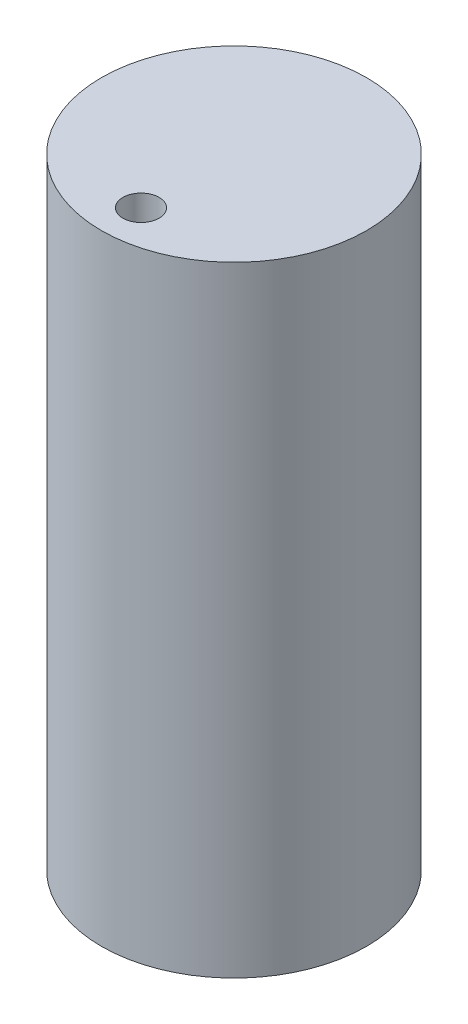
ISO-10303-21;
HEADER;
FILE_DESCRIPTION(('STEP AP214'),'2;1');
FILE_NAME('part.step','',(''),(''),'','','');
FILE_SCHEMA(('AUTOMOTIVE_DESIGN { 1 0 10303 214 1 1 1 1 }'));
ENDSEC;
DATA;
#1=APPLICATION_CONTEXT('core data for automotive mechanical design processes');
#2=APPLICATION_PROTOCOL_DEFINITION('international standard','automotive_design',2000,#1);
#3=PRODUCT_CONTEXT('',#1,'mechanical');
#4=PRODUCT('Part','Part','',(#3));
#5=PRODUCT_RELATED_PRODUCT_CATEGORY('part','',(#4));
#6=PRODUCT_DEFINITION_FORMATION('','',#4);
#7=PRODUCT_DEFINITION_CONTEXT('part definition',#1,'design');
#8=PRODUCT_DEFINITION('design','',#6,#7);
#9=PRODUCT_DEFINITION_SHAPE('','',#8);
#10=(LENGTH_UNIT() NAMED_UNIT(*) SI_UNIT(.MILLI.,.METRE.));
#11=(NAMED_UNIT(*) PLANE_ANGLE_UNIT() SI_UNIT($,.RADIAN.));
#12=(NAMED_UNIT(*) SI_UNIT($,.STERADIAN.) SOLID_ANGLE_UNIT());
#13=UNCERTAINTY_MEASURE_WITH_UNIT(LENGTH_MEASURE(1.E-05),#10,'distance_accuracy_value','');
#14=(GEOMETRIC_REPRESENTATION_CONTEXT(3) GLOBAL_UNCERTAINTY_ASSIGNED_CONTEXT((#13)) GLOBAL_UNIT_ASSIGNED_CONTEXT((#10,
#11,#12)) REPRESENTATION_CONTEXT('',''));
#15=CARTESIAN_POINT('',(0.,0.,0.));
#16=DIRECTION('',(0.,0.,1.));
#17=DIRECTION('',(1.,0.,0.));
#18=AXIS2_PLACEMENT_3D('',#15,#16,#17);
#19=CARTESIAN_POINT('',(0.,50.,0.));
#20=DIRECTION('',(0.,1.,0.));
#21=DIRECTION('',(0.,0.,1.));
#22=AXIS2_PLACEMENT_3D('',#19,#20,#21);
#23=PLANE('',#22);
#24=CARTESIAN_POINT('',(0.,50.,0.));
#25=DIRECTION('',(0.,1.,0.));
#26=DIRECTION('',(0.,0.,1.));
#27=AXIS2_PLACEMENT_3D('',#24,#25,#26);
#28=CIRCLE('',#27,10.6900128240723);
#29=CARTESIAN_POINT('',(0.,50.,10.6900128240723));
#30=VERTEX_POINT('',#29);
#31=EDGE_CURVE('E10',#30,#30,#28,.T.);
#32=ORIENTED_EDGE('',*,*,#31,.T.);
#33=EDGE_LOOP('',(#32));
#34=FACE_BOUND('',#33,.T.);
#35=CARTESIAN_POINT('',(0.,50.,7.5));
#36=DIRECTION('',(0.,1.,0.));
#37=DIRECTION('',(0.,0.,1.));
#38=AXIS2_PLACEMENT_3D('',#35,#36,#37);
#39=CIRCLE('',#38,1.45772902146441);
#40=CARTESIAN_POINT('',(0.,50.,8.95772902146441));
#41=VERTEX_POINT('',#40);
#42=EDGE_CURVE('E54',#41,#41,#39,.T.);
#43=ORIENTED_EDGE('',*,*,#42,.F.);
#44=EDGE_LOOP('',(#43));
#45=FACE_BOUND('',#44,.T.);
#46=ADVANCED_FACE('F41',(#34,#45),#23,.T.);
#47=CARTESIAN_POINT('',(0.,0.,0.));
#48=DIRECTION('',(0.,1.,0.));
#49=DIRECTION('',(0.,0.,1.));
#50=AXIS2_PLACEMENT_3D('',#47,#48,#49);
#51=PLANE('',#50);
#52=CARTESIAN_POINT('',(0.,0.,0.));
#53=DIRECTION('',(0.,1.,0.));
#54=DIRECTION('',(0.,0.,1.));
#55=AXIS2_PLACEMENT_3D('',#52,#53,#54);
#56=CIRCLE('',#55,10.6900128240723);
#57=CARTESIAN_POINT('',(0.,0.,10.6900128240723));
#58=VERTEX_POINT('',#57);
#59=EDGE_CURVE('E45',#58,#58,#56,.T.);
#60=ORIENTED_EDGE('',*,*,#59,.F.);
#61=EDGE_LOOP('',(#60));
#62=FACE_BOUND('',#61,.T.);
#63=CARTESIAN_POINT('',(0.,0.,7.5));
#64=DIRECTION('',(0.,1.,0.));
#65=DIRECTION('',(0.,0.,1.));
#66=AXIS2_PLACEMENT_3D('',#63,#64,#65);
#67=CIRCLE('',#66,1.45772902146441);
#68=CARTESIAN_POINT('',(0.,0.,8.95772902146441));
#69=VERTEX_POINT('',#68);
#70=EDGE_CURVE('E56',#69,#69,#67,.T.);
#71=ORIENTED_EDGE('',*,*,#70,.T.);
#72=EDGE_LOOP('',(#71));
#73=FACE_BOUND('',#72,.T.);
#74=ADVANCED_FACE('F68',(#62,#73),#51,.F.);
#75=CARTESIAN_POINT('',(0.,50.,0.));
#76=DIRECTION('',(0.,-1.,0.));
#77=DIRECTION('',(0.,0.,-1.));
#78=AXIS2_PLACEMENT_3D('',#75,#76,#77);
#79=CYLINDRICAL_SURFACE('',#78,10.6900128240723);
#80=ORIENTED_EDGE('',*,*,#31,.F.);
#81=EDGE_LOOP('',(#80));
#82=FACE_BOUND('',#81,.T.);
#83=ORIENTED_EDGE('',*,*,#59,.T.);
#84=EDGE_LOOP('',(#83));
#85=FACE_BOUND('',#84,.T.);
#86=ADVANCED_FACE('F43',(#82,#85),#79,.T.);
#87=CARTESIAN_POINT('',(0.,50.,7.5));
#88=DIRECTION('',(0.,-1.,0.));
#89=DIRECTION('',(0.,0.,-1.));
#90=AXIS2_PLACEMENT_3D('',#87,#88,#89);
#91=CYLINDRICAL_SURFACE('',#90,1.45772902146441);
#92=ORIENTED_EDGE('',*,*,#42,.T.);
#93=EDGE_LOOP('',(#92));
#94=FACE_BOUND('',#93,.T.);
#95=ORIENTED_EDGE('',*,*,#70,.F.);
#96=EDGE_LOOP('',(#95));
#97=FACE_BOUND('',#96,.T.);
#98=ADVANCED_FACE('F64',(#94,#97),#91,.F.);
#99=CLOSED_SHELL('',(#46,#74,#86,#98));
#100=MANIFOLD_SOLID_BREP('B2',#99);
#101=ADVANCED_BREP_SHAPE_REPRESENTATION('',(#18,#100),#14);
#102=SHAPE_DEFINITION_REPRESENTATION(#9,#101);
ENDSEC;
END-ISO-10303-21;
